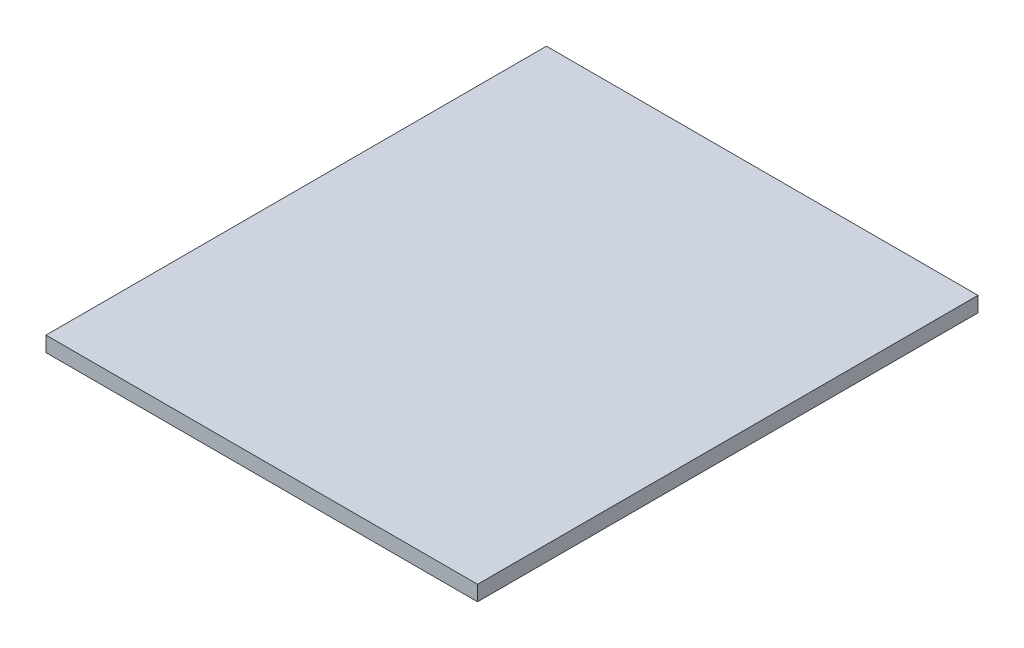
ISO-10303-21;
HEADER;
FILE_DESCRIPTION(('STEP AP214'),'2;1');
FILE_NAME('part.step','',(''),(''),'','','');
FILE_SCHEMA(('AUTOMOTIVE_DESIGN { 1 0 10303 214 1 1 1 1 }'));
ENDSEC;
DATA;
#1=APPLICATION_CONTEXT('core data for automotive mechanical design processes');
#2=APPLICATION_PROTOCOL_DEFINITION('international standard','automotive_design',2000,#1);
#3=PRODUCT_CONTEXT('',#1,'mechanical');
#4=PRODUCT('Part','Part','',(#3));
#5=PRODUCT_RELATED_PRODUCT_CATEGORY('part','',(#4));
#6=PRODUCT_DEFINITION_FORMATION('','',#4);
#7=PRODUCT_DEFINITION_CONTEXT('part definition',#1,'design');
#8=PRODUCT_DEFINITION('design','',#6,#7);
#9=PRODUCT_DEFINITION_SHAPE('','',#8);
#10=(LENGTH_UNIT() NAMED_UNIT(*) SI_UNIT(.MILLI.,.METRE.));
#11=(NAMED_UNIT(*) PLANE_ANGLE_UNIT() SI_UNIT($,.RADIAN.));
#12=(NAMED_UNIT(*) SI_UNIT($,.STERADIAN.) SOLID_ANGLE_UNIT());
#13=UNCERTAINTY_MEASURE_WITH_UNIT(LENGTH_MEASURE(1.E-05),#10,'distance_accuracy_value','');
#14=(GEOMETRIC_REPRESENTATION_CONTEXT(3) GLOBAL_UNCERTAINTY_ASSIGNED_CONTEXT((#13)) GLOBAL_UNIT_ASSIGNED_CONTEXT((#10,
#11,#12)) REPRESENTATION_CONTEXT('',''));
#15=CARTESIAN_POINT('',(0.,0.,0.));
#16=DIRECTION('',(0.,0.,1.));
#17=DIRECTION('',(1.,0.,0.));
#18=AXIS2_PLACEMENT_3D('',#15,#16,#17);
#19=CARTESIAN_POINT('',(-44.2815420560747,3.,-20.6980140186916));
#20=DIRECTION('',(1.,0.,0.));
#21=DIRECTION('',(0.,0.,-1.));
#22=AXIS2_PLACEMENT_3D('',#19,#20,#21);
#23=PLANE('',#22);
#24=DIRECTION('',(0.,0.,1.));
#25=VECTOR('',#24,1.);
#26=CARTESIAN_POINT('',(-44.2815420560747,0.,-20.6980140186916));
#27=LINE('',#26,#25);
#28=CARTESIAN_POINT('',(-44.2815420560747,0.,-20.6980140186916));
#29=VERTEX_POINT('',#28);
#30=CARTESIAN_POINT('',(-44.2815420560747,0.,78.1019859813084));
#31=VERTEX_POINT('',#30);
#32=EDGE_CURVE('E96',#29,#31,#27,.T.);
#33=ORIENTED_EDGE('',*,*,#32,.T.);
#34=DIRECTION('',(0.,-1.,0.));
#35=VECTOR('',#34,1.);
#36=CARTESIAN_POINT('',(-44.2815420560747,3.,78.1019859813084));
#37=LINE('',#36,#35);
#38=CARTESIAN_POINT('',(-44.2815420560747,3.,78.1019859813084));
#39=VERTEX_POINT('',#38);
#40=EDGE_CURVE('E11',#39,#31,#37,.T.);
#41=ORIENTED_EDGE('',*,*,#40,.F.);
#42=DIRECTION('',(0.,0.,1.));
#43=VECTOR('',#42,1.);
#44=CARTESIAN_POINT('',(-44.2815420560747,3.,-20.6980140186916));
#45=LINE('',#44,#43);
#46=CARTESIAN_POINT('',(-44.2815420560747,3.,-20.6980140186916));
#47=VERTEX_POINT('',#46);
#48=EDGE_CURVE('E84',#47,#39,#45,.T.);
#49=ORIENTED_EDGE('',*,*,#48,.F.);
#50=DIRECTION('',(0.,-1.,0.));
#51=VECTOR('',#50,1.);
#52=CARTESIAN_POINT('',(-44.2815420560747,3.,-20.6980140186916));
#53=LINE('',#52,#51);
#54=EDGE_CURVE('E92',#47,#29,#53,.T.);
#55=ORIENTED_EDGE('',*,*,#54,.T.);
#56=EDGE_LOOP('',(#33,#41,#49,#55));
#57=FACE_BOUND('',#56,.T.);
#58=ADVANCED_FACE('F33',(#57),#23,.F.);
#59=CARTESIAN_POINT('',(-44.2815420560747,3.,78.1019859813084));
#60=DIRECTION('',(0.,0.,-1.));
#61=DIRECTION('',(-1.,0.,0.));
#62=AXIS2_PLACEMENT_3D('',#59,#60,#61);
#63=PLANE('',#62);
#64=DIRECTION('',(1.,0.,0.));
#65=VECTOR('',#64,1.);
#66=CARTESIAN_POINT('',(-44.2815420560747,0.,78.1019859813084));
#67=LINE('',#66,#65);
#68=CARTESIAN_POINT('',(40.9184579439253,0.,78.1019859813084));
#69=VERTEX_POINT('',#68);
#70=EDGE_CURVE('E88',#31,#69,#67,.T.);
#71=ORIENTED_EDGE('',*,*,#70,.T.);
#72=DIRECTION('',(0.,-1.,0.));
#73=VECTOR('',#72,1.);
#74=CARTESIAN_POINT('',(40.9184579439253,3.,78.1019859813084));
#75=LINE('',#74,#73);
#76=CARTESIAN_POINT('',(40.9184579439253,3.,78.1019859813084));
#77=VERTEX_POINT('',#76);
#78=EDGE_CURVE('E41',#77,#69,#75,.T.);
#79=ORIENTED_EDGE('',*,*,#78,.F.);
#80=DIRECTION('',(1.,0.,0.));
#81=VECTOR('',#80,1.);
#82=CARTESIAN_POINT('',(-44.2815420560747,3.,78.1019859813084));
#83=LINE('',#82,#81);
#84=EDGE_CURVE('E79',#39,#77,#83,.T.);
#85=ORIENTED_EDGE('',*,*,#84,.F.);
#86=ORIENTED_EDGE('',*,*,#40,.T.);
#87=EDGE_LOOP('',(#71,#79,#85,#86));
#88=FACE_BOUND('',#87,.T.);
#89=ADVANCED_FACE('F87',(#88),#63,.F.);
#90=CARTESIAN_POINT('',(40.9184579439252,3.,-20.6980140186916));
#91=DIRECTION('',(-1.,0.,0.));
#92=DIRECTION('',(0.,0.,1.));
#93=AXIS2_PLACEMENT_3D('',#90,#91,#92);
#94=PLANE('',#93);
#95=DIRECTION('',(0.,0.,-1.));
#96=VECTOR('',#95,1.);
#97=CARTESIAN_POINT('',(40.9184579439252,0.,-20.6980140186916));
#98=LINE('',#97,#96);
#99=CARTESIAN_POINT('',(40.9184579439252,0.,-20.6980140186916));
#100=VERTEX_POINT('',#99);
#101=EDGE_CURVE('E66',#69,#100,#98,.T.);
#102=ORIENTED_EDGE('',*,*,#101,.T.);
#103=DIRECTION('',(0.,-1.,0.));
#104=VECTOR('',#103,1.);
#105=CARTESIAN_POINT('',(40.9184579439252,3.,-20.6980140186916));
#106=LINE('',#105,#104);
#107=CARTESIAN_POINT('',(40.9184579439252,3.,-20.6980140186916));
#108=VERTEX_POINT('',#107);
#109=EDGE_CURVE('E89',#108,#100,#106,.T.);
#110=ORIENTED_EDGE('',*,*,#109,.F.);
#111=DIRECTION('',(0.,0.,-1.));
#112=VECTOR('',#111,1.);
#113=CARTESIAN_POINT('',(40.9184579439252,3.,-20.6980140186916));
#114=LINE('',#113,#112);
#115=EDGE_CURVE('E82',#77,#108,#114,.T.);
#116=ORIENTED_EDGE('',*,*,#115,.F.);
#117=ORIENTED_EDGE('',*,*,#78,.T.);
#118=EDGE_LOOP('',(#102,#110,#116,#117));
#119=FACE_BOUND('',#118,.T.);
#120=ADVANCED_FACE('F90',(#119),#94,.F.);
#121=CARTESIAN_POINT('',(-44.2815420560747,3.,-20.6980140186916));
#122=DIRECTION('',(0.,0.,1.));
#123=DIRECTION('',(1.,0.,0.));
#124=AXIS2_PLACEMENT_3D('',#121,#122,#123);
#125=PLANE('',#124);
#126=DIRECTION('',(-1.,0.,0.));
#127=VECTOR('',#126,1.);
#128=CARTESIAN_POINT('',(-44.2815420560747,0.,-20.6980140186916));
#129=LINE('',#128,#127);
#130=EDGE_CURVE('E72',#100,#29,#129,.T.);
#131=ORIENTED_EDGE('',*,*,#130,.T.);
#132=ORIENTED_EDGE('',*,*,#54,.F.);
#133=DIRECTION('',(-1.,0.,0.));
#134=VECTOR('',#133,1.);
#135=CARTESIAN_POINT('',(-44.2815420560747,3.,-20.6980140186916));
#136=LINE('',#135,#134);
#137=EDGE_CURVE('E49',#108,#47,#136,.T.);
#138=ORIENTED_EDGE('',*,*,#137,.F.);
#139=ORIENTED_EDGE('',*,*,#109,.T.);
#140=EDGE_LOOP('',(#131,#132,#138,#139));
#141=FACE_BOUND('',#140,.T.);
#142=ADVANCED_FACE('F103',(#141),#125,.F.);
#143=CARTESIAN_POINT('',(0.,3.,0.));
#144=DIRECTION('',(0.,1.,0.));
#145=DIRECTION('',(0.,0.,1.));
#146=AXIS2_PLACEMENT_3D('',#143,#144,#145);
#147=PLANE('',#146);
#148=ORIENTED_EDGE('',*,*,#48,.T.);
#149=ORIENTED_EDGE('',*,*,#84,.T.);
#150=ORIENTED_EDGE('',*,*,#115,.T.);
#151=ORIENTED_EDGE('',*,*,#137,.T.);
#152=EDGE_LOOP('',(#148,#149,#150,#151));
#153=FACE_BOUND('',#152,.T.);
#154=ADVANCED_FACE('F80',(#153),#147,.T.);
#155=CARTESIAN_POINT('',(0.,0.,0.));
#156=DIRECTION('',(0.,1.,0.));
#157=DIRECTION('',(0.,0.,1.));
#158=AXIS2_PLACEMENT_3D('',#155,#156,#157);
#159=PLANE('',#158);
#160=ORIENTED_EDGE('',*,*,#32,.F.);
#161=ORIENTED_EDGE('',*,*,#130,.F.);
#162=ORIENTED_EDGE('',*,*,#101,.F.);
#163=ORIENTED_EDGE('',*,*,#70,.F.);
#164=EDGE_LOOP('',(#160,#161,#162,#163));
#165=FACE_BOUND('',#164,.T.);
#166=ADVANCED_FACE('F106',(#165),#159,.F.);
#167=CLOSED_SHELL('',(#58,#89,#120,#142,#154,#166));
#168=MANIFOLD_SOLID_BREP('B2',#167);
#169=ADVANCED_BREP_SHAPE_REPRESENTATION('',(#18,#168),#14);
#170=SHAPE_DEFINITION_REPRESENTATION(#9,#169);
ENDSEC;
END-ISO-10303-21;
